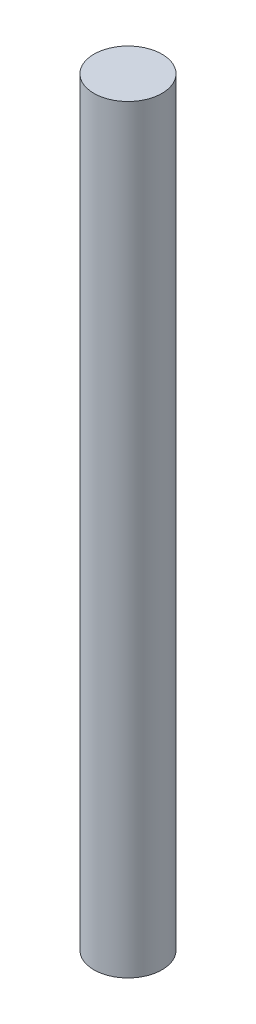
ISO-10303-21;
HEADER;
FILE_DESCRIPTION(('STEP AP214'),'2;1');
FILE_NAME('part.step','',(''),(''),'','','');
FILE_SCHEMA(('AUTOMOTIVE_DESIGN { 1 0 10303 214 1 1 1 1 }'));
ENDSEC;
DATA;
#1=APPLICATION_CONTEXT('core data for automotive mechanical design processes');
#2=APPLICATION_PROTOCOL_DEFINITION('international standard','automotive_design',2000,#1);
#3=PRODUCT_CONTEXT('',#1,'mechanical');
#4=PRODUCT('Part','Part','',(#3));
#5=PRODUCT_RELATED_PRODUCT_CATEGORY('part','',(#4));
#6=PRODUCT_DEFINITION_FORMATION('','',#4);
#7=PRODUCT_DEFINITION_CONTEXT('part definition',#1,'design');
#8=PRODUCT_DEFINITION('design','',#6,#7);
#9=PRODUCT_DEFINITION_SHAPE('','',#8);
#10=(LENGTH_UNIT() NAMED_UNIT(*) SI_UNIT(.MILLI.,.METRE.));
#11=(NAMED_UNIT(*) PLANE_ANGLE_UNIT() SI_UNIT($,.RADIAN.));
#12=(NAMED_UNIT(*) SI_UNIT($,.STERADIAN.) SOLID_ANGLE_UNIT());
#13=UNCERTAINTY_MEASURE_WITH_UNIT(LENGTH_MEASURE(1.E-05),#10,'distance_accuracy_value','');
#14=(GEOMETRIC_REPRESENTATION_CONTEXT(3) GLOBAL_UNCERTAINTY_ASSIGNED_CONTEXT((#13)) GLOBAL_UNIT_ASSIGNED_CONTEXT((#10,
#11,#12)) REPRESENTATION_CONTEXT('',''));
#15=CARTESIAN_POINT('',(0.,0.,0.));
#16=DIRECTION('',(0.,0.,1.));
#17=DIRECTION('',(1.,0.,0.));
#18=AXIS2_PLACEMENT_3D('',#15,#16,#17);
#19=CARTESIAN_POINT('',(0.,24.,0.));
#20=DIRECTION('',(0.,-1.,0.));
#21=DIRECTION('',(0.,0.,-1.));
#22=AXIS2_PLACEMENT_3D('',#19,#20,#21);
#23=CYLINDRICAL_SURFACE('',#22,1.075);
#24=CARTESIAN_POINT('',(0.,24.,0.));
#25=DIRECTION('',(0.,1.,0.));
#26=DIRECTION('',(0.,0.,1.));
#27=AXIS2_PLACEMENT_3D('',#24,#25,#26);
#28=CIRCLE('',#27,1.075);
#29=CARTESIAN_POINT('',(0.,24.,1.075));
#30=VERTEX_POINT('',#29);
#31=EDGE_CURVE('E10',#30,#30,#28,.T.);
#32=ORIENTED_EDGE('',*,*,#31,.F.);
#33=EDGE_LOOP('',(#32));
#34=FACE_BOUND('',#33,.T.);
#35=CARTESIAN_POINT('',(0.,0.,0.));
#36=DIRECTION('',(0.,1.,0.));
#37=DIRECTION('',(0.,0.,1.));
#38=AXIS2_PLACEMENT_3D('',#35,#36,#37);
#39=CIRCLE('',#38,1.075);
#40=CARTESIAN_POINT('',(0.,0.,1.075));
#41=VERTEX_POINT('',#40);
#42=EDGE_CURVE('E46',#41,#41,#39,.T.);
#43=ORIENTED_EDGE('',*,*,#42,.T.);
#44=EDGE_LOOP('',(#43));
#45=FACE_BOUND('',#44,.T.);
#46=ADVANCED_FACE('F43',(#34,#45),#23,.T.);
#47=CARTESIAN_POINT('',(0.,24.,0.));
#48=DIRECTION('',(0.,1.,0.));
#49=DIRECTION('',(0.,0.,1.));
#50=AXIS2_PLACEMENT_3D('',#47,#48,#49);
#51=PLANE('',#50);
#52=ORIENTED_EDGE('',*,*,#31,.T.);
#53=EDGE_LOOP('',(#52));
#54=FACE_BOUND('',#53,.T.);
#55=ADVANCED_FACE('F60',(#54),#51,.T.);
#56=CARTESIAN_POINT('',(0.,0.,0.));
#57=DIRECTION('',(0.,1.,0.));
#58=DIRECTION('',(0.,0.,1.));
#59=AXIS2_PLACEMENT_3D('',#56,#57,#58);
#60=PLANE('',#59);
#61=ORIENTED_EDGE('',*,*,#42,.F.);
#62=EDGE_LOOP('',(#61));
#63=FACE_BOUND('',#62,.T.);
#64=ADVANCED_FACE('F58',(#63),#60,.F.);
#65=CLOSED_SHELL('',(#46,#55,#64));
#66=MANIFOLD_SOLID_BREP('B2',#65);
#67=ADVANCED_BREP_SHAPE_REPRESENTATION('',(#18,#66),#14);
#68=SHAPE_DEFINITION_REPRESENTATION(#9,#67);
ENDSEC;
END-ISO-10303-21;
